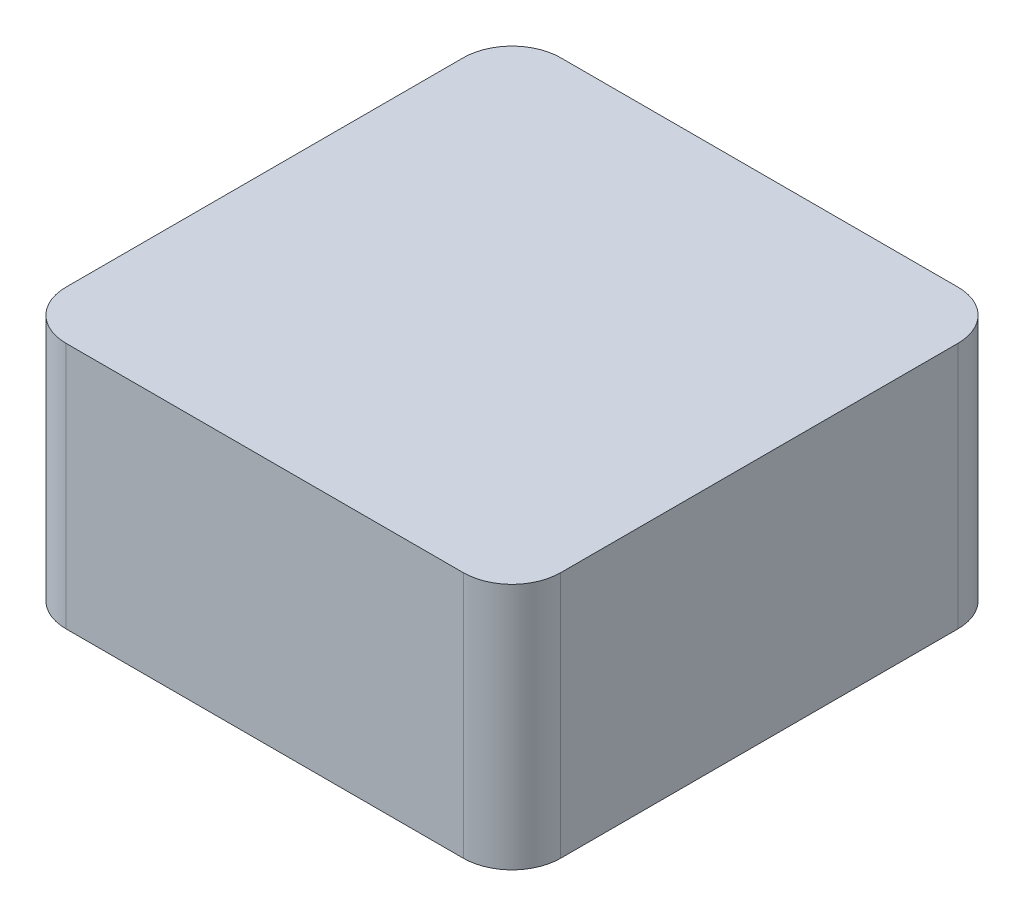
ISO-10303-21;
HEADER;
FILE_DESCRIPTION(('STEP AP214'),'2;1');
FILE_NAME('part.step','',(''),(''),'','','');
FILE_SCHEMA(('AUTOMOTIVE_DESIGN { 1 0 10303 214 1 1 1 1 }'));
ENDSEC;
DATA;
#1=APPLICATION_CONTEXT('core data for automotive mechanical design processes');
#2=APPLICATION_PROTOCOL_DEFINITION('international standard','automotive_design',2000,#1);
#3=PRODUCT_CONTEXT('',#1,'mechanical');
#4=PRODUCT('Part','Part','',(#3));
#5=PRODUCT_RELATED_PRODUCT_CATEGORY('part','',(#4));
#6=PRODUCT_DEFINITION_FORMATION('','',#4);
#7=PRODUCT_DEFINITION_CONTEXT('part definition',#1,'design');
#8=PRODUCT_DEFINITION('design','',#6,#7);
#9=PRODUCT_DEFINITION_SHAPE('','',#8);
#10=(LENGTH_UNIT() NAMED_UNIT(*) SI_UNIT(.MILLI.,.METRE.));
#11=(NAMED_UNIT(*) PLANE_ANGLE_UNIT() SI_UNIT($,.RADIAN.));
#12=(NAMED_UNIT(*) SI_UNIT($,.STERADIAN.) SOLID_ANGLE_UNIT());
#13=UNCERTAINTY_MEASURE_WITH_UNIT(LENGTH_MEASURE(1.E-05),#10,'distance_accuracy_value','');
#14=(GEOMETRIC_REPRESENTATION_CONTEXT(3) GLOBAL_UNCERTAINTY_ASSIGNED_CONTEXT((#13)) GLOBAL_UNIT_ASSIGNED_CONTEXT((#10,
#11,#12)) REPRESENTATION_CONTEXT('',''));
#15=CARTESIAN_POINT('',(0.,0.,0.));
#16=DIRECTION('',(0.,0.,1.));
#17=DIRECTION('',(1.,0.,0.));
#18=AXIS2_PLACEMENT_3D('',#15,#16,#17);
#19=CARTESIAN_POINT('',(0.,0.,203.2));
#20=DIRECTION('',(1.,0.,0.));
#21=DIRECTION('',(0.,0.,-1.));
#22=AXIS2_PLACEMENT_3D('',#19,#20,#21);
#23=PLANE('',#22);
#24=DIRECTION('',(0.,0.,-1.));
#25=VECTOR('',#24,1.);
#26=CARTESIAN_POINT('',(0.,0.,203.2));
#27=LINE('',#26,#25);
#28=CARTESIAN_POINT('',(0.,0.,183.2));
#29=VERTEX_POINT('',#28);
#30=CARTESIAN_POINT('',(0.,0.,20.));
#31=VERTEX_POINT('',#30);
#32=EDGE_CURVE('E205',#29,#31,#27,.T.);
#33=ORIENTED_EDGE('',*,*,#32,.F.);
#34=DIRECTION('',(0.,-1.,0.));
#35=VECTOR('',#34,1.);
#36=CARTESIAN_POINT('',(0.,101.6,183.2));
#37=LINE('',#36,#35);
#38=CARTESIAN_POINT('',(0.,101.6,183.2));
#39=VERTEX_POINT('',#38);
#40=EDGE_CURVE('E244',#29,#39,#37,.F.);
#41=ORIENTED_EDGE('',*,*,#40,.T.);
#42=DIRECTION('',(0.,0.,-1.));
#43=VECTOR('',#42,1.);
#44=CARTESIAN_POINT('',(0.,101.6,203.2));
#45=LINE('',#44,#43);
#46=CARTESIAN_POINT('',(0.,101.6,20.));
#47=VERTEX_POINT('',#46);
#48=EDGE_CURVE('E191',#39,#47,#45,.T.);
#49=ORIENTED_EDGE('',*,*,#48,.T.);
#50=DIRECTION('',(0.,-1.,0.));
#51=VECTOR('',#50,1.);
#52=CARTESIAN_POINT('',(0.,0.,20.));
#53=LINE('',#52,#51);
#54=EDGE_CURVE('E208',#47,#31,#53,.T.);
#55=ORIENTED_EDGE('',*,*,#54,.T.);
#56=EDGE_LOOP('',(#33,#41,#49,#55));
#57=FACE_BOUND('',#56,.T.);
#58=ADVANCED_FACE('F43',(#57),#23,.F.);
#59=CARTESIAN_POINT('',(0.,0.,203.2));
#60=DIRECTION('',(0.,1.,0.));
#61=DIRECTION('',(0.,0.,1.));
#62=AXIS2_PLACEMENT_3D('',#59,#60,#61);
#63=PLANE('',#62);
#64=DIRECTION('',(-1.,0.,0.));
#65=VECTOR('',#64,1.);
#66=CARTESIAN_POINT('',(23.8,0.,176.2));
#67=LINE('',#66,#65);
#68=CARTESIAN_POINT('',(176.2,0.,176.2));
#69=VERTEX_POINT('',#68);
#70=CARTESIAN_POINT('',(23.8,0.,176.2));
#71=VERTEX_POINT('',#70);
#72=EDGE_CURVE('E168',#69,#71,#67,.T.);
#73=ORIENTED_EDGE('',*,*,#72,.F.);
#74=DIRECTION('',(0.,0.,1.));
#75=VECTOR('',#74,1.);
#76=CARTESIAN_POINT('',(176.2,0.,176.2));
#77=LINE('',#76,#75);
#78=CARTESIAN_POINT('',(176.2,0.,23.8));
#79=VERTEX_POINT('',#78);
#80=EDGE_CURVE('E59',#79,#69,#77,.T.);
#81=ORIENTED_EDGE('',*,*,#80,.F.);
#82=DIRECTION('',(1.,0.,0.));
#83=VECTOR('',#82,1.);
#84=CARTESIAN_POINT('',(23.8,0.,23.8));
#85=LINE('',#84,#83);
#86=CARTESIAN_POINT('',(23.8,0.,23.8));
#87=VERTEX_POINT('',#86);
#88=EDGE_CURVE('E155',#87,#79,#85,.T.);
#89=ORIENTED_EDGE('',*,*,#88,.F.);
#90=DIRECTION('',(0.,0.,-1.));
#91=VECTOR('',#90,1.);
#92=CARTESIAN_POINT('',(23.8,0.,176.2));
#93=LINE('',#92,#91);
#94=EDGE_CURVE('E159',#71,#87,#93,.T.);
#95=ORIENTED_EDGE('',*,*,#94,.F.);
#96=EDGE_LOOP('',(#73,#81,#89,#95));
#97=FACE_BOUND('',#96,.T.);
#98=DIRECTION('',(0.,0.,-1.));
#99=VECTOR('',#98,1.);
#100=CARTESIAN_POINT('',(203.2,0.,203.2));
#101=LINE('',#100,#99);
#102=CARTESIAN_POINT('',(203.2,0.,183.2));
#103=VERTEX_POINT('',#102);
#104=CARTESIAN_POINT('',(203.2,0.,20.));
#105=VERTEX_POINT('',#104);
#106=EDGE_CURVE('E202',#103,#105,#101,.T.);
#107=ORIENTED_EDGE('',*,*,#106,.F.);
#108=CARTESIAN_POINT('',(183.2,0.,183.2));
#109=DIRECTION('',(0.,1.,0.));
#110=DIRECTION('',(0.,0.,1.));
#111=AXIS2_PLACEMENT_3D('',#108,#109,#110);
#112=CIRCLE('',#111,20.);
#113=CARTESIAN_POINT('',(183.2,0.,203.2));
#114=VERTEX_POINT('',#113);
#115=EDGE_CURVE('E11',#103,#114,#112,.F.);
#116=ORIENTED_EDGE('',*,*,#115,.T.);
#117=DIRECTION('',(1.,0.,0.));
#118=VECTOR('',#117,1.);
#119=CARTESIAN_POINT('',(0.,0.,203.2));
#120=LINE('',#119,#118);
#121=CARTESIAN_POINT('',(20.,0.,203.2));
#122=VERTEX_POINT('',#121);
#123=EDGE_CURVE('E183',#122,#114,#120,.T.);
#124=ORIENTED_EDGE('',*,*,#123,.F.);
#125=CARTESIAN_POINT('',(20.,0.,183.2));
#126=DIRECTION('',(0.,1.,0.));
#127=DIRECTION('',(0.,0.,1.));
#128=AXIS2_PLACEMENT_3D('',#125,#126,#127);
#129=CIRCLE('',#128,20.);
#130=EDGE_CURVE('E241',#122,#29,#129,.F.);
#131=ORIENTED_EDGE('',*,*,#130,.T.);
#132=ORIENTED_EDGE('',*,*,#32,.T.);
#133=CARTESIAN_POINT('',(20.,0.,20.));
#134=DIRECTION('',(0.,1.,0.));
#135=DIRECTION('',(0.,0.,1.));
#136=AXIS2_PLACEMENT_3D('',#133,#134,#135);
#137=CIRCLE('',#136,20.);
#138=CARTESIAN_POINT('',(20.,0.,0.));
#139=VERTEX_POINT('',#138);
#140=EDGE_CURVE('E212',#31,#139,#137,.F.);
#141=ORIENTED_EDGE('',*,*,#140,.T.);
#142=DIRECTION('',(1.,0.,0.));
#143=VECTOR('',#142,1.);
#144=CARTESIAN_POINT('',(0.,0.,0.));
#145=LINE('',#144,#143);
#146=CARTESIAN_POINT('',(183.2,0.,0.));
#147=VERTEX_POINT('',#146);
#148=EDGE_CURVE('E177',#139,#147,#145,.T.);
#149=ORIENTED_EDGE('',*,*,#148,.T.);
#150=CARTESIAN_POINT('',(183.2,0.,20.));
#151=DIRECTION('',(0.,1.,0.));
#152=DIRECTION('',(0.,0.,1.));
#153=AXIS2_PLACEMENT_3D('',#150,#151,#152);
#154=CIRCLE('',#153,20.);
#155=EDGE_CURVE('E233',#147,#105,#154,.F.);
#156=ORIENTED_EDGE('',*,*,#155,.T.);
#157=EDGE_LOOP('',(#107,#116,#124,#131,#132,#141,#149,#156));
#158=FACE_BOUND('',#157,.T.);
#159=ADVANCED_FACE('F269',(#97,#158),#63,.F.);
#160=CARTESIAN_POINT('',(203.2,0.,203.2));
#161=DIRECTION('',(-1.,0.,0.));
#162=DIRECTION('',(0.,0.,1.));
#163=AXIS2_PLACEMENT_3D('',#160,#161,#162);
#164=PLANE('',#163);
#165=DIRECTION('',(0.,0.,-1.));
#166=VECTOR('',#165,1.);
#167=CARTESIAN_POINT('',(203.2,101.6,203.2));
#168=LINE('',#167,#166);
#169=CARTESIAN_POINT('',(203.2,101.6,183.2));
#170=VERTEX_POINT('',#169);
#171=CARTESIAN_POINT('',(203.2,101.6,20.));
#172=VERTEX_POINT('',#171);
#173=EDGE_CURVE('E199',#170,#172,#168,.T.);
#174=ORIENTED_EDGE('',*,*,#173,.F.);
#175=DIRECTION('',(0.,1.,0.));
#176=VECTOR('',#175,1.);
#177=CARTESIAN_POINT('',(203.2,0.,183.2));
#178=LINE('',#177,#176);
#179=EDGE_CURVE('E52',#170,#103,#178,.F.);
#180=ORIENTED_EDGE('',*,*,#179,.T.);
#181=ORIENTED_EDGE('',*,*,#106,.T.);
#182=DIRECTION('',(0.,1.,0.));
#183=VECTOR('',#182,1.);
#184=CARTESIAN_POINT('',(203.2,0.,20.));
#185=LINE('',#184,#183);
#186=EDGE_CURVE('E223',#105,#172,#185,.T.);
#187=ORIENTED_EDGE('',*,*,#186,.T.);
#188=EDGE_LOOP('',(#174,#180,#181,#187));
#189=FACE_BOUND('',#188,.T.);
#190=ADVANCED_FACE('F264',(#189),#164,.F.);
#191=CARTESIAN_POINT('',(203.2,101.6,203.2));
#192=DIRECTION('',(0.,-1.,0.));
#193=DIRECTION('',(0.,0.,-1.));
#194=AXIS2_PLACEMENT_3D('',#191,#192,#193);
#195=PLANE('',#194);
#196=DIRECTION('',(-1.,0.,0.));
#197=VECTOR('',#196,1.);
#198=CARTESIAN_POINT('',(203.2,101.6,203.2));
#199=LINE('',#198,#197);
#200=CARTESIAN_POINT('',(183.2,101.6,203.2));
#201=VERTEX_POINT('',#200);
#202=CARTESIAN_POINT('',(20.,101.6,203.2));
#203=VERTEX_POINT('',#202);
#204=EDGE_CURVE('E187',#201,#203,#199,.T.);
#205=ORIENTED_EDGE('',*,*,#204,.F.);
#206=CARTESIAN_POINT('',(183.2,101.6,183.2));
#207=DIRECTION('',(0.,-1.,0.));
#208=DIRECTION('',(0.,0.,-1.));
#209=AXIS2_PLACEMENT_3D('',#206,#207,#208);
#210=CIRCLE('',#209,20.);
#211=EDGE_CURVE('E255',#201,#170,#210,.F.);
#212=ORIENTED_EDGE('',*,*,#211,.T.);
#213=ORIENTED_EDGE('',*,*,#173,.T.);
#214=CARTESIAN_POINT('',(183.2,101.6,20.));
#215=DIRECTION('',(0.,-1.,0.));
#216=DIRECTION('',(0.,0.,-1.));
#217=AXIS2_PLACEMENT_3D('',#214,#215,#216);
#218=CIRCLE('',#217,20.);
#219=CARTESIAN_POINT('',(183.2,101.6,0.));
#220=VERTEX_POINT('',#219);
#221=EDGE_CURVE('E227',#172,#220,#218,.F.);
#222=ORIENTED_EDGE('',*,*,#221,.T.);
#223=DIRECTION('',(-1.,0.,0.));
#224=VECTOR('',#223,1.);
#225=CARTESIAN_POINT('',(203.2,101.6,0.));
#226=LINE('',#225,#224);
#227=CARTESIAN_POINT('',(20.,101.6,0.));
#228=VERTEX_POINT('',#227);
#229=EDGE_CURVE('E188',#220,#228,#226,.T.);
#230=ORIENTED_EDGE('',*,*,#229,.T.);
#231=CARTESIAN_POINT('',(20.,101.6,20.));
#232=DIRECTION('',(0.,-1.,0.));
#233=DIRECTION('',(0.,0.,-1.));
#234=AXIS2_PLACEMENT_3D('',#231,#232,#233);
#235=CIRCLE('',#234,20.);
#236=EDGE_CURVE('E219',#228,#47,#235,.F.);
#237=ORIENTED_EDGE('',*,*,#236,.T.);
#238=ORIENTED_EDGE('',*,*,#48,.F.);
#239=CARTESIAN_POINT('',(20.,101.6,183.2));
#240=DIRECTION('',(0.,-1.,0.));
#241=DIRECTION('',(0.,0.,-1.));
#242=AXIS2_PLACEMENT_3D('',#239,#240,#241);
#243=CIRCLE('',#242,20.);
#244=EDGE_CURVE('E247',#39,#203,#243,.F.);
#245=ORIENTED_EDGE('',*,*,#244,.T.);
#246=EDGE_LOOP('',(#205,#212,#213,#222,#230,#237,#238,#245));
#247=FACE_BOUND('',#246,.T.);
#248=ADVANCED_FACE('F260',(#247),#195,.F.);
#249=CARTESIAN_POINT('',(0.,0.,203.2));
#250=DIRECTION('',(0.,0.,1.));
#251=DIRECTION('',(1.,0.,0.));
#252=AXIS2_PLACEMENT_3D('',#249,#250,#251);
#253=PLANE('',#252);
#254=ORIENTED_EDGE('',*,*,#123,.T.);
#255=DIRECTION('',(0.,1.,0.));
#256=VECTOR('',#255,1.);
#257=CARTESIAN_POINT('',(183.2,101.6,203.2));
#258=LINE('',#257,#256);
#259=EDGE_CURVE('E251',#114,#201,#258,.T.);
#260=ORIENTED_EDGE('',*,*,#259,.T.);
#261=ORIENTED_EDGE('',*,*,#204,.T.);
#262=DIRECTION('',(0.,-1.,0.));
#263=VECTOR('',#262,1.);
#264=CARTESIAN_POINT('',(20.,0.,203.2));
#265=LINE('',#264,#263);
#266=EDGE_CURVE('E237',#203,#122,#265,.T.);
#267=ORIENTED_EDGE('',*,*,#266,.T.);
#268=EDGE_LOOP('',(#254,#260,#261,#267));
#269=FACE_BOUND('',#268,.T.);
#270=ADVANCED_FACE('F271',(#269),#253,.T.);
#271=CARTESIAN_POINT('',(0.,0.,0.));
#272=DIRECTION('',(0.,0.,1.));
#273=DIRECTION('',(1.,0.,0.));
#274=AXIS2_PLACEMENT_3D('',#271,#272,#273);
#275=PLANE('',#274);
#276=ORIENTED_EDGE('',*,*,#229,.F.);
#277=DIRECTION('',(0.,1.,0.));
#278=VECTOR('',#277,1.);
#279=CARTESIAN_POINT('',(183.2,0.,0.));
#280=LINE('',#279,#278);
#281=EDGE_CURVE('E230',#220,#147,#280,.F.);
#282=ORIENTED_EDGE('',*,*,#281,.T.);
#283=ORIENTED_EDGE('',*,*,#148,.F.);
#284=DIRECTION('',(0.,-1.,0.));
#285=VECTOR('',#284,1.);
#286=CARTESIAN_POINT('',(20.,0.,0.));
#287=LINE('',#286,#285);
#288=EDGE_CURVE('E215',#139,#228,#287,.F.);
#289=ORIENTED_EDGE('',*,*,#288,.T.);
#290=EDGE_LOOP('',(#276,#282,#283,#289));
#291=FACE_BOUND('',#290,.T.);
#292=ADVANCED_FACE('F290',(#291),#275,.F.);
#293=CARTESIAN_POINT('',(20.,0.,20.));
#294=DIRECTION('',(0.,-1.,0.));
#295=DIRECTION('',(0.,0.,-1.));
#296=AXIS2_PLACEMENT_3D('',#293,#294,#295);
#297=CYLINDRICAL_SURFACE('',#296,20.);
#298=ORIENTED_EDGE('',*,*,#236,.F.);
#299=ORIENTED_EDGE('',*,*,#288,.F.);
#300=ORIENTED_EDGE('',*,*,#140,.F.);
#301=ORIENTED_EDGE('',*,*,#54,.F.);
#302=EDGE_LOOP('',(#298,#299,#300,#301));
#303=FACE_BOUND('',#302,.T.);
#304=ADVANCED_FACE('F284',(#303),#297,.T.);
#305=CARTESIAN_POINT('',(183.2,0.,20.));
#306=DIRECTION('',(0.,1.,0.));
#307=DIRECTION('',(0.,0.,1.));
#308=AXIS2_PLACEMENT_3D('',#305,#306,#307);
#309=CYLINDRICAL_SURFACE('',#308,20.);
#310=ORIENTED_EDGE('',*,*,#155,.F.);
#311=ORIENTED_EDGE('',*,*,#281,.F.);
#312=ORIENTED_EDGE('',*,*,#221,.F.);
#313=ORIENTED_EDGE('',*,*,#186,.F.);
#314=EDGE_LOOP('',(#310,#311,#312,#313));
#315=FACE_BOUND('',#314,.T.);
#316=ADVANCED_FACE('F293',(#315),#309,.T.);
#317=CARTESIAN_POINT('',(20.,0.,183.2));
#318=DIRECTION('',(0.,1.,0.));
#319=DIRECTION('',(0.,0.,1.));
#320=AXIS2_PLACEMENT_3D('',#317,#318,#319);
#321=CYLINDRICAL_SURFACE('',#320,20.);
#322=ORIENTED_EDGE('',*,*,#244,.F.);
#323=ORIENTED_EDGE('',*,*,#40,.F.);
#324=ORIENTED_EDGE('',*,*,#130,.F.);
#325=ORIENTED_EDGE('',*,*,#266,.F.);
#326=EDGE_LOOP('',(#322,#323,#324,#325));
#327=FACE_BOUND('',#326,.T.);
#328=ADVANCED_FACE('F275',(#327),#321,.T.);
#329=CARTESIAN_POINT('',(183.2,0.,183.2));
#330=DIRECTION('',(0.,-1.,0.));
#331=DIRECTION('',(0.,0.,-1.));
#332=AXIS2_PLACEMENT_3D('',#329,#330,#331);
#333=CYLINDRICAL_SURFACE('',#332,20.);
#334=ORIENTED_EDGE('',*,*,#115,.F.);
#335=ORIENTED_EDGE('',*,*,#179,.F.);
#336=ORIENTED_EDGE('',*,*,#211,.F.);
#337=ORIENTED_EDGE('',*,*,#259,.F.);
#338=EDGE_LOOP('',(#334,#335,#336,#337));
#339=FACE_BOUND('',#338,.T.);
#340=ADVANCED_FACE('F45',(#339),#333,.T.);
#341=CARTESIAN_POINT('',(176.2,88.9,176.2));
#342=DIRECTION('',(1.,0.,0.));
#343=DIRECTION('',(0.,0.,-1.));
#344=AXIS2_PLACEMENT_3D('',#341,#342,#343);
#345=PLANE('',#344);
#346=ORIENTED_EDGE('',*,*,#80,.T.);
#347=DIRECTION('',(0.,-1.,0.));
#348=VECTOR('',#347,1.);
#349=CARTESIAN_POINT('',(176.2,88.9,176.2));
#350=LINE('',#349,#348);
#351=CARTESIAN_POINT('',(176.2,88.9,176.2));
#352=VERTEX_POINT('',#351);
#353=EDGE_CURVE('E130',#352,#69,#350,.T.);
#354=ORIENTED_EDGE('',*,*,#353,.F.);
#355=DIRECTION('',(0.,0.,1.));
#356=VECTOR('',#355,1.);
#357=CARTESIAN_POINT('',(176.2,88.9,176.2));
#358=LINE('',#357,#356);
#359=CARTESIAN_POINT('',(176.2,88.9,23.8));
#360=VERTEX_POINT('',#359);
#361=EDGE_CURVE('E134',#360,#352,#358,.T.);
#362=ORIENTED_EDGE('',*,*,#361,.F.);
#363=DIRECTION('',(0.,-1.,0.));
#364=VECTOR('',#363,1.);
#365=CARTESIAN_POINT('',(176.2,88.9,23.8));
#366=LINE('',#365,#364);
#367=EDGE_CURVE('E174',#360,#79,#366,.T.);
#368=ORIENTED_EDGE('',*,*,#367,.T.);
#369=EDGE_LOOP('',(#346,#354,#362,#368));
#370=FACE_BOUND('',#369,.T.);
#371=ADVANCED_FACE('F132',(#370),#345,.F.);
#372=CARTESIAN_POINT('',(23.8,88.9,23.8));
#373=DIRECTION('',(0.,0.,-1.));
#374=DIRECTION('',(-1.,0.,0.));
#375=AXIS2_PLACEMENT_3D('',#372,#373,#374);
#376=PLANE('',#375);
#377=ORIENTED_EDGE('',*,*,#88,.T.);
#378=ORIENTED_EDGE('',*,*,#367,.F.);
#379=DIRECTION('',(1.,0.,0.));
#380=VECTOR('',#379,1.);
#381=CARTESIAN_POINT('',(23.8,88.9,23.8));
#382=LINE('',#381,#380);
#383=CARTESIAN_POINT('',(23.8,88.9,23.8));
#384=VERTEX_POINT('',#383);
#385=EDGE_CURVE('E141',#384,#360,#382,.T.);
#386=ORIENTED_EDGE('',*,*,#385,.F.);
#387=DIRECTION('',(0.,-1.,0.));
#388=VECTOR('',#387,1.);
#389=CARTESIAN_POINT('',(23.8,88.9,23.8));
#390=LINE('',#389,#388);
#391=EDGE_CURVE('E178',#384,#87,#390,.T.);
#392=ORIENTED_EDGE('',*,*,#391,.T.);
#393=EDGE_LOOP('',(#377,#378,#386,#392));
#394=FACE_BOUND('',#393,.T.);
#395=ADVANCED_FACE('F319',(#394),#376,.F.);
#396=CARTESIAN_POINT('',(23.8,88.9,176.2));
#397=DIRECTION('',(-1.,0.,0.));
#398=DIRECTION('',(0.,0.,1.));
#399=AXIS2_PLACEMENT_3D('',#396,#397,#398);
#400=PLANE('',#399);
#401=ORIENTED_EDGE('',*,*,#94,.T.);
#402=ORIENTED_EDGE('',*,*,#391,.F.);
#403=DIRECTION('',(0.,0.,-1.));
#404=VECTOR('',#403,1.);
#405=CARTESIAN_POINT('',(23.8,88.9,176.2));
#406=LINE('',#405,#404);
#407=CARTESIAN_POINT('',(23.8,88.9,176.2));
#408=VERTEX_POINT('',#407);
#409=EDGE_CURVE('E150',#408,#384,#406,.T.);
#410=ORIENTED_EDGE('',*,*,#409,.F.);
#411=DIRECTION('',(0.,-1.,0.));
#412=VECTOR('',#411,1.);
#413=CARTESIAN_POINT('',(23.8,88.9,176.2));
#414=LINE('',#413,#412);
#415=EDGE_CURVE('E140',#408,#71,#414,.T.);
#416=ORIENTED_EDGE('',*,*,#415,.T.);
#417=EDGE_LOOP('',(#401,#402,#410,#416));
#418=FACE_BOUND('',#417,.T.);
#419=ADVANCED_FACE('F322',(#418),#400,.F.);
#420=CARTESIAN_POINT('',(23.8,88.9,176.2));
#421=DIRECTION('',(0.,0.,1.));
#422=DIRECTION('',(1.,0.,0.));
#423=AXIS2_PLACEMENT_3D('',#420,#421,#422);
#424=PLANE('',#423);
#425=ORIENTED_EDGE('',*,*,#72,.T.);
#426=ORIENTED_EDGE('',*,*,#415,.F.);
#427=DIRECTION('',(-1.,0.,0.));
#428=VECTOR('',#427,1.);
#429=CARTESIAN_POINT('',(23.8,88.9,176.2));
#430=LINE('',#429,#428);
#431=EDGE_CURVE('E144',#352,#408,#430,.T.);
#432=ORIENTED_EDGE('',*,*,#431,.F.);
#433=ORIENTED_EDGE('',*,*,#353,.T.);
#434=EDGE_LOOP('',(#425,#426,#432,#433));
#435=FACE_BOUND('',#434,.T.);
#436=ADVANCED_FACE('F145',(#435),#424,.F.);
#437=CARTESIAN_POINT('',(0.,88.9,0.));
#438=DIRECTION('',(0.,-1.,0.));
#439=DIRECTION('',(0.,0.,-1.));
#440=AXIS2_PLACEMENT_3D('',#437,#438,#439);
#441=PLANE('',#440);
#442=ORIENTED_EDGE('',*,*,#361,.T.);
#443=ORIENTED_EDGE('',*,*,#431,.T.);
#444=ORIENTED_EDGE('',*,*,#409,.T.);
#445=ORIENTED_EDGE('',*,*,#385,.T.);
#446=EDGE_LOOP('',(#442,#443,#444,#445));
#447=FACE_BOUND('',#446,.T.);
#448=ADVANCED_FACE('F152',(#447),#441,.T.);
#449=CLOSED_SHELL('',(#58,#159,#190,#248,#270,#292,#304,#316,#328,#340,#371,#395,#419,#436,#448));
#450=MANIFOLD_SOLID_BREP('B2',#449);
#451=ADVANCED_BREP_SHAPE_REPRESENTATION('',(#18,#450),#14);
#452=SHAPE_DEFINITION_REPRESENTATION(#9,#451);
ENDSEC;
END-ISO-10303-21;
